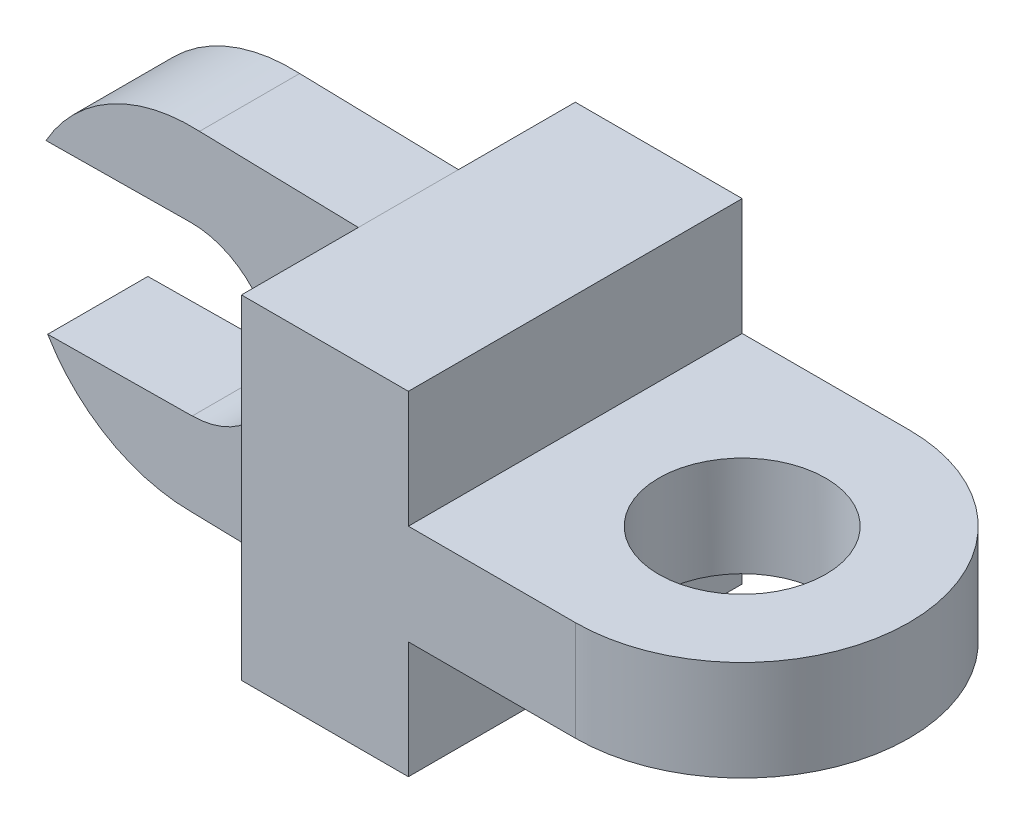
ISO-10303-21;
HEADER;
FILE_DESCRIPTION(('STEP AP214'),'2;1');
FILE_NAME('part.step','',(''),(''),'','','');
FILE_SCHEMA(('AUTOMOTIVE_DESIGN { 1 0 10303 214 1 1 1 1 }'));
ENDSEC;
DATA;
#1=APPLICATION_CONTEXT('core data for automotive mechanical design processes');
#2=APPLICATION_PROTOCOL_DEFINITION('international standard','automotive_design',2000,#1);
#3=PRODUCT_CONTEXT('',#1,'mechanical');
#4=PRODUCT('Part','Part','',(#3));
#5=PRODUCT_RELATED_PRODUCT_CATEGORY('part','',(#4));
#6=PRODUCT_DEFINITION_FORMATION('','',#4);
#7=PRODUCT_DEFINITION_CONTEXT('part definition',#1,'design');
#8=PRODUCT_DEFINITION('design','',#6,#7);
#9=PRODUCT_DEFINITION_SHAPE('','',#8);
#10=(LENGTH_UNIT() NAMED_UNIT(*) SI_UNIT(.MILLI.,.METRE.));
#11=(NAMED_UNIT(*) PLANE_ANGLE_UNIT() SI_UNIT($,.RADIAN.));
#12=(NAMED_UNIT(*) SI_UNIT($,.STERADIAN.) SOLID_ANGLE_UNIT());
#13=UNCERTAINTY_MEASURE_WITH_UNIT(LENGTH_MEASURE(1.E-05),#10,'distance_accuracy_value','');
#14=(GEOMETRIC_REPRESENTATION_CONTEXT(3) GLOBAL_UNCERTAINTY_ASSIGNED_CONTEXT((#13)) GLOBAL_UNIT_ASSIGNED_CONTEXT((#10,
#11,#12)) REPRESENTATION_CONTEXT('',''));
#15=CARTESIAN_POINT('',(0.,0.,0.));
#16=DIRECTION('',(0.,0.,1.));
#17=DIRECTION('',(1.,0.,0.));
#18=AXIS2_PLACEMENT_3D('',#15,#16,#17);
#19=CARTESIAN_POINT('',(-100.,51.2184310821307,15.));
#20=DIRECTION('',(0.,0.,-1.));
#21=DIRECTION('',(-1.,0.,0.));
#22=AXIS2_PLACEMENT_3D('',#19,#20,#21);
#23=CYLINDRICAL_SURFACE('',#22,50.);
#24=CARTESIAN_POINT('',(-100.,51.2184310821307,-15.));
#25=DIRECTION('',(0.,0.,1.));
#26=DIRECTION('',(1.,0.,0.));
#27=AXIS2_PLACEMENT_3D('',#24,#25,#26);
#28=CIRCLE('',#27,50.);
#29=CARTESIAN_POINT('',(-97.5645840581075,101.1590833525,-15.));
#30=VERTEX_POINT('',#29);
#31=CARTESIAN_POINT('',(-143.554760872011,75.7741392857638,-15.));
#32=VERTEX_POINT('',#31);
#33=EDGE_CURVE('E190',#30,#32,#28,.T.);
#34=ORIENTED_EDGE('',*,*,#33,.T.);
#35=DIRECTION('',(0.,0.,-1.));
#36=VECTOR('',#35,1.);
#37=CARTESIAN_POINT('',(-143.554760872011,75.7741392857638,15.));
#38=LINE('',#37,#36);
#39=CARTESIAN_POINT('',(-143.554760872011,75.7741392857638,15.));
#40=VERTEX_POINT('',#39);
#41=EDGE_CURVE('E170',#32,#40,#38,.F.);
#42=ORIENTED_EDGE('',*,*,#41,.T.);
#43=CARTESIAN_POINT('',(-100.,51.2184310821307,15.));
#44=DIRECTION('',(0.,0.,1.));
#45=DIRECTION('',(1.,0.,0.));
#46=AXIS2_PLACEMENT_3D('',#43,#44,#45);
#47=CIRCLE('',#46,50.);
#48=CARTESIAN_POINT('',(-97.5645840581075,101.1590833525,15.));
#49=VERTEX_POINT('',#48);
#50=EDGE_CURVE('E182',#49,#40,#47,.T.);
#51=ORIENTED_EDGE('',*,*,#50,.F.);
#52=DIRECTION('',(0.,0.,-1.));
#53=VECTOR('',#52,1.);
#54=CARTESIAN_POINT('',(-97.5645840581075,101.1590833525,15.));
#55=LINE('',#54,#53);
#56=EDGE_CURVE('E199',#49,#30,#55,.T.);
#57=ORIENTED_EDGE('',*,*,#56,.T.);
#58=EDGE_LOOP('',(#34,#42,#51,#57));
#59=FACE_BOUND('',#58,.T.);
#60=ADVANCED_FACE('F32',(#59),#23,.T.);
#61=CARTESIAN_POINT('',(-50.,100.,-50.));
#62=DIRECTION('',(1.,0.,0.));
#63=DIRECTION('',(0.,0.,-1.));
#64=AXIS2_PLACEMENT_3D('',#61,#62,#63);
#65=PLANE('',#64);
#66=DIRECTION('',(0.,1.,0.));
#67=VECTOR('',#66,1.);
#68=CARTESIAN_POINT('',(-50.,100.,15.));
#69=LINE('',#68,#67);
#70=CARTESIAN_POINT('',(-50.,0.,15.));
#71=VERTEX_POINT('',#70);
#72=CARTESIAN_POINT('',(-50.,100.,15.));
#73=VERTEX_POINT('',#72);
#74=EDGE_CURVE('E175',#71,#73,#69,.T.);
#75=ORIENTED_EDGE('',*,*,#74,.F.);
#76=DIRECTION('',(0.,0.,1.));
#77=VECTOR('',#76,1.);
#78=CARTESIAN_POINT('',(-50.,0.,-50.));
#79=LINE('',#78,#77);
#80=CARTESIAN_POINT('',(-50.,0.,50.));
#81=VERTEX_POINT('',#80);
#82=EDGE_CURVE('E261',#71,#81,#79,.T.);
#83=ORIENTED_EDGE('',*,*,#82,.T.);
#84=DIRECTION('',(0.,-1.,0.));
#85=VECTOR('',#84,1.);
#86=CARTESIAN_POINT('',(-50.,100.,50.));
#87=LINE('',#86,#85);
#88=CARTESIAN_POINT('',(-50.,100.,50.));
#89=VERTEX_POINT('',#88);
#90=EDGE_CURVE('E255',#89,#81,#87,.T.);
#91=ORIENTED_EDGE('',*,*,#90,.F.);
#92=DIRECTION('',(0.,0.,1.));
#93=VECTOR('',#92,1.);
#94=CARTESIAN_POINT('',(-50.,100.,-50.));
#95=LINE('',#94,#93);
#96=EDGE_CURVE('E251',#73,#89,#95,.T.);
#97=ORIENTED_EDGE('',*,*,#96,.F.);
#98=EDGE_LOOP('',(#75,#83,#91,#97));
#99=FACE_BOUND('',#98,.T.);
#100=ADVANCED_FACE('F327',(#99),#65,.F.);
#101=CARTESIAN_POINT('',(-50.,100.,50.));
#102=DIRECTION('',(0.,0.,-1.));
#103=DIRECTION('',(-1.,0.,0.));
#104=AXIS2_PLACEMENT_3D('',#101,#102,#103);
#105=PLANE('',#104);
#106=DIRECTION('',(0.,-1.,0.));
#107=VECTOR('',#106,1.);
#108=CARTESIAN_POINT('',(0.,35.,50.));
#109=LINE('',#108,#107);
#110=CARTESIAN_POINT('',(0.,35.,50.));
#111=VERTEX_POINT('',#110);
#112=CARTESIAN_POINT('',(0.,0.,50.));
#113=VERTEX_POINT('',#112);
#114=EDGE_CURVE('E210',#111,#113,#109,.T.);
#115=ORIENTED_EDGE('',*,*,#114,.F.);
#116=DIRECTION('',(-1.,0.,0.));
#117=VECTOR('',#116,1.);
#118=CARTESIAN_POINT('',(0.,35.,50.));
#119=LINE('',#118,#117);
#120=CARTESIAN_POINT('',(50.,35.,50.));
#121=VERTEX_POINT('',#120);
#122=EDGE_CURVE('E205',#121,#111,#119,.T.);
#123=ORIENTED_EDGE('',*,*,#122,.F.);
#124=DIRECTION('',(0.,-1.,0.));
#125=VECTOR('',#124,1.);
#126=CARTESIAN_POINT('',(50.,100.,50.));
#127=LINE('',#126,#125);
#128=CARTESIAN_POINT('',(50.,65.,50.));
#129=VERTEX_POINT('',#128);
#130=EDGE_CURVE('E11',#129,#121,#127,.T.);
#131=ORIENTED_EDGE('',*,*,#130,.F.);
#132=DIRECTION('',(1.,0.,0.));
#133=VECTOR('',#132,1.);
#134=CARTESIAN_POINT('',(0.,65.,50.));
#135=LINE('',#134,#133);
#136=CARTESIAN_POINT('',(0.,65.,50.));
#137=VERTEX_POINT('',#136);
#138=EDGE_CURVE('E229',#137,#129,#135,.T.);
#139=ORIENTED_EDGE('',*,*,#138,.F.);
#140=DIRECTION('',(0.,-1.,0.));
#141=VECTOR('',#140,1.);
#142=CARTESIAN_POINT('',(0.,65.,50.));
#143=LINE('',#142,#141);
#144=CARTESIAN_POINT('',(0.,100.,50.));
#145=VERTEX_POINT('',#144);
#146=EDGE_CURVE('E224',#145,#137,#143,.T.);
#147=ORIENTED_EDGE('',*,*,#146,.F.);
#148=DIRECTION('',(1.,0.,0.));
#149=VECTOR('',#148,1.);
#150=CARTESIAN_POINT('',(-50.,100.,50.));
#151=LINE('',#150,#149);
#152=EDGE_CURVE('E244',#89,#145,#151,.T.);
#153=ORIENTED_EDGE('',*,*,#152,.F.);
#154=ORIENTED_EDGE('',*,*,#90,.T.);
#155=DIRECTION('',(1.,0.,0.));
#156=VECTOR('',#155,1.);
#157=CARTESIAN_POINT('',(-50.,0.,50.));
#158=LINE('',#157,#156);
#159=EDGE_CURVE('E243',#81,#113,#158,.T.);
#160=ORIENTED_EDGE('',*,*,#159,.T.);
#161=EDGE_LOOP('',(#115,#123,#131,#139,#147,#153,#154,#160));
#162=FACE_BOUND('',#161,.T.);
#163=ADVANCED_FACE('F34',(#162),#105,.F.);
#164=CARTESIAN_POINT('',(50.,100.,0.));
#165=DIRECTION('',(0.,-1.,0.));
#166=DIRECTION('',(0.,0.,-1.));
#167=AXIS2_PLACEMENT_3D('',#164,#165,#166);
#168=CYLINDRICAL_SURFACE('',#167,50.);
#169=ORIENTED_EDGE('',*,*,#130,.T.);
#170=CARTESIAN_POINT('',(50.,35.,0.));
#171=DIRECTION('',(0.,1.,0.));
#172=DIRECTION('',(0.,0.,1.));
#173=AXIS2_PLACEMENT_3D('',#170,#171,#172);
#174=CIRCLE('',#173,50.);
#175=CARTESIAN_POINT('',(50.,35.,-50.));
#176=VERTEX_POINT('',#175);
#177=EDGE_CURVE('E221',#121,#176,#174,.T.);
#178=ORIENTED_EDGE('',*,*,#177,.T.);
#179=DIRECTION('',(0.,-1.,0.));
#180=VECTOR('',#179,1.);
#181=CARTESIAN_POINT('',(50.,100.,-50.));
#182=LINE('',#181,#180);
#183=CARTESIAN_POINT('',(50.,65.,-50.));
#184=VERTEX_POINT('',#183);
#185=EDGE_CURVE('E41',#184,#176,#182,.T.);
#186=ORIENTED_EDGE('',*,*,#185,.F.);
#187=CARTESIAN_POINT('',(50.,65.,0.));
#188=DIRECTION('',(0.,-1.,0.));
#189=DIRECTION('',(0.,0.,-1.));
#190=AXIS2_PLACEMENT_3D('',#187,#188,#189);
#191=CIRCLE('',#190,50.);
#192=EDGE_CURVE('E240',#184,#129,#191,.T.);
#193=ORIENTED_EDGE('',*,*,#192,.T.);
#194=EDGE_LOOP('',(#169,#178,#186,#193));
#195=FACE_BOUND('',#194,.T.);
#196=ADVANCED_FACE('F299',(#195),#168,.T.);
#197=CARTESIAN_POINT('',(-50.,100.,-50.));
#198=DIRECTION('',(0.,0.,-1.));
#199=DIRECTION('',(-1.,0.,0.));
#200=AXIS2_PLACEMENT_3D('',#197,#198,#199);
#201=PLANE('',#200);
#202=DIRECTION('',(-1.,0.,0.));
#203=VECTOR('',#202,1.);
#204=CARTESIAN_POINT('',(0.,35.,-50.));
#205=LINE('',#204,#203);
#206=CARTESIAN_POINT('',(0.,35.,-50.));
#207=VERTEX_POINT('',#206);
#208=EDGE_CURVE('E206',#176,#207,#205,.T.);
#209=ORIENTED_EDGE('',*,*,#208,.T.);
#210=DIRECTION('',(0.,-1.,0.));
#211=VECTOR('',#210,1.);
#212=CARTESIAN_POINT('',(0.,35.,-50.));
#213=LINE('',#212,#211);
#214=CARTESIAN_POINT('',(0.,0.,-50.));
#215=VERTEX_POINT('',#214);
#216=EDGE_CURVE('E209',#207,#215,#213,.T.);
#217=ORIENTED_EDGE('',*,*,#216,.T.);
#218=DIRECTION('',(1.,0.,0.));
#219=VECTOR('',#218,1.);
#220=CARTESIAN_POINT('',(-50.,0.,-50.));
#221=LINE('',#220,#219);
#222=CARTESIAN_POINT('',(-50.,0.,-50.));
#223=VERTEX_POINT('',#222);
#224=EDGE_CURVE('E258',#223,#215,#221,.T.);
#225=ORIENTED_EDGE('',*,*,#224,.F.);
#226=DIRECTION('',(0.,-1.,0.));
#227=VECTOR('',#226,1.);
#228=CARTESIAN_POINT('',(-50.,100.,-50.));
#229=LINE('',#228,#227);
#230=CARTESIAN_POINT('',(-50.,100.,-50.));
#231=VERTEX_POINT('',#230);
#232=EDGE_CURVE('E266',#231,#223,#229,.T.);
#233=ORIENTED_EDGE('',*,*,#232,.F.);
#234=DIRECTION('',(1.,0.,0.));
#235=VECTOR('',#234,1.);
#236=CARTESIAN_POINT('',(-50.,100.,-50.));
#237=LINE('',#236,#235);
#238=CARTESIAN_POINT('',(0.,100.,-50.));
#239=VERTEX_POINT('',#238);
#240=EDGE_CURVE('E247',#231,#239,#237,.T.);
#241=ORIENTED_EDGE('',*,*,#240,.T.);
#242=DIRECTION('',(0.,-1.,0.));
#243=VECTOR('',#242,1.);
#244=CARTESIAN_POINT('',(0.,65.,-50.));
#245=LINE('',#244,#243);
#246=CARTESIAN_POINT('',(0.,65.,-50.));
#247=VERTEX_POINT('',#246);
#248=EDGE_CURVE('E225',#239,#247,#245,.T.);
#249=ORIENTED_EDGE('',*,*,#248,.T.);
#250=DIRECTION('',(1.,0.,0.));
#251=VECTOR('',#250,1.);
#252=CARTESIAN_POINT('',(0.,65.,-50.));
#253=LINE('',#252,#251);
#254=EDGE_CURVE('E228',#247,#184,#253,.T.);
#255=ORIENTED_EDGE('',*,*,#254,.T.);
#256=ORIENTED_EDGE('',*,*,#185,.T.);
#257=EDGE_LOOP('',(#209,#217,#225,#233,#241,#249,#255,#256));
#258=FACE_BOUND('',#257,.T.);
#259=ADVANCED_FACE('F282',(#258),#201,.T.);
#260=CARTESIAN_POINT('',(-50.,0.,-15.));
#261=VERTEX_POINT('',#260);
#262=EDGE_CURVE('E248',#223,#261,#79,.T.);
#263=ORIENTED_EDGE('',*,*,#262,.T.);
#264=DIRECTION('',(0.,1.,0.));
#265=VECTOR('',#264,1.);
#266=CARTESIAN_POINT('',(-50.,100.,-15.));
#267=LINE('',#266,#265);
#268=CARTESIAN_POINT('',(-50.,100.,-15.));
#269=VERTEX_POINT('',#268);
#270=EDGE_CURVE('E165',#261,#269,#267,.T.);
#271=ORIENTED_EDGE('',*,*,#270,.T.);
#272=EDGE_CURVE('E252',#231,#269,#95,.T.);
#273=ORIENTED_EDGE('',*,*,#272,.F.);
#274=ORIENTED_EDGE('',*,*,#232,.T.);
#275=EDGE_LOOP('',(#263,#271,#273,#274));
#276=FACE_BOUND('',#275,.T.);
#277=ADVANCED_FACE('F312',(#276),#65,.F.);
#278=CARTESIAN_POINT('',(50.,100.,0.));
#279=DIRECTION('',(0.,1.,0.));
#280=DIRECTION('',(0.,0.,1.));
#281=AXIS2_PLACEMENT_3D('',#278,#279,#280);
#282=PLANE('',#281);
#283=DIRECTION('',(0.,0.,1.));
#284=VECTOR('',#283,1.);
#285=CARTESIAN_POINT('',(0.,100.,-50.));
#286=LINE('',#285,#284);
#287=EDGE_CURVE('E232',#239,#145,#286,.T.);
#288=ORIENTED_EDGE('',*,*,#287,.F.);
#289=ORIENTED_EDGE('',*,*,#240,.F.);
#290=ORIENTED_EDGE('',*,*,#272,.T.);
#291=DIRECTION('',(0.,0.,-1.));
#292=VECTOR('',#291,1.);
#293=CARTESIAN_POINT('',(-50.,100.,15.));
#294=LINE('',#293,#292);
#295=EDGE_CURVE('E202',#73,#269,#294,.T.);
#296=ORIENTED_EDGE('',*,*,#295,.F.);
#297=ORIENTED_EDGE('',*,*,#96,.T.);
#298=ORIENTED_EDGE('',*,*,#152,.T.);
#299=EDGE_LOOP('',(#288,#289,#290,#296,#297,#298));
#300=FACE_BOUND('',#299,.T.);
#301=ADVANCED_FACE('F288',(#300),#282,.T.);
#302=CARTESIAN_POINT('',(50.,0.,0.));
#303=DIRECTION('',(0.,1.,0.));
#304=DIRECTION('',(0.,0.,1.));
#305=AXIS2_PLACEMENT_3D('',#302,#303,#304);
#306=PLANE('',#305);
#307=ORIENTED_EDGE('',*,*,#224,.T.);
#308=DIRECTION('',(0.,0.,1.));
#309=VECTOR('',#308,1.);
#310=CARTESIAN_POINT('',(0.,0.,-50.));
#311=LINE('',#310,#309);
#312=EDGE_CURVE('E216',#215,#113,#311,.T.);
#313=ORIENTED_EDGE('',*,*,#312,.T.);
#314=ORIENTED_EDGE('',*,*,#159,.F.);
#315=ORIENTED_EDGE('',*,*,#82,.F.);
#316=DIRECTION('',(0.,0.,-1.));
#317=VECTOR('',#316,1.);
#318=CARTESIAN_POINT('',(-50.,0.,15.));
#319=LINE('',#318,#317);
#320=EDGE_CURVE('E187',#71,#261,#319,.T.);
#321=ORIENTED_EDGE('',*,*,#320,.T.);
#322=ORIENTED_EDGE('',*,*,#262,.F.);
#323=EDGE_LOOP('',(#307,#313,#314,#315,#321,#322));
#324=FACE_BOUND('',#323,.T.);
#325=ADVANCED_FACE('F307',(#324),#306,.F.);
#326=CARTESIAN_POINT('',(50.,0.,0.));
#327=DIRECTION('',(0.,1.,0.));
#328=DIRECTION('',(0.,0.,1.));
#329=AXIS2_PLACEMENT_3D('',#326,#327,#328);
#330=CYLINDRICAL_SURFACE('',#329,25.);
#331=CARTESIAN_POINT('',(50.,35.,0.));
#332=DIRECTION('',(0.,1.,0.));
#333=DIRECTION('',(0.,0.,1.));
#334=AXIS2_PLACEMENT_3D('',#331,#332,#333);
#335=CIRCLE('',#334,25.);
#336=CARTESIAN_POINT('',(50.,35.,25.));
#337=VERTEX_POINT('',#336);
#338=EDGE_CURVE('E36',#337,#337,#335,.F.);
#339=ORIENTED_EDGE('',*,*,#338,.T.);
#340=EDGE_LOOP('',(#339));
#341=FACE_BOUND('',#340,.T.);
#342=CARTESIAN_POINT('',(50.,65.,0.));
#343=DIRECTION('',(0.,-1.,0.));
#344=DIRECTION('',(0.,0.,-1.));
#345=AXIS2_PLACEMENT_3D('',#342,#343,#344);
#346=CIRCLE('',#345,25.);
#347=CARTESIAN_POINT('',(50.,65.,-25.));
#348=VERTEX_POINT('',#347);
#349=EDGE_CURVE('E238',#348,#348,#346,.F.);
#350=ORIENTED_EDGE('',*,*,#349,.T.);
#351=EDGE_LOOP('',(#350));
#352=FACE_BOUND('',#351,.T.);
#353=ADVANCED_FACE('F272',(#341,#352),#330,.F.);
#354=CARTESIAN_POINT('',(0.,65.,-50.));
#355=DIRECTION('',(0.,-1.,0.));
#356=DIRECTION('',(0.,0.,-1.));
#357=AXIS2_PLACEMENT_3D('',#354,#355,#356);
#358=PLANE('',#357);
#359=ORIENTED_EDGE('',*,*,#349,.F.);
#360=EDGE_LOOP('',(#359));
#361=FACE_BOUND('',#360,.T.);
#362=ORIENTED_EDGE('',*,*,#254,.F.);
#363=DIRECTION('',(0.,0.,1.));
#364=VECTOR('',#363,1.);
#365=CARTESIAN_POINT('',(0.,65.,-50.));
#366=LINE('',#365,#364);
#367=EDGE_CURVE('E236',#247,#137,#366,.T.);
#368=ORIENTED_EDGE('',*,*,#367,.T.);
#369=ORIENTED_EDGE('',*,*,#138,.T.);
#370=ORIENTED_EDGE('',*,*,#192,.F.);
#371=EDGE_LOOP('',(#362,#368,#369,#370));
#372=FACE_BOUND('',#371,.T.);
#373=ADVANCED_FACE('F274',(#361,#372),#358,.F.);
#374=CARTESIAN_POINT('',(0.,65.,-50.));
#375=DIRECTION('',(-1.,0.,0.));
#376=DIRECTION('',(0.,-1.,0.));
#377=AXIS2_PLACEMENT_3D('',#374,#375,#376);
#378=PLANE('',#377);
#379=ORIENTED_EDGE('',*,*,#146,.T.);
#380=ORIENTED_EDGE('',*,*,#367,.F.);
#381=ORIENTED_EDGE('',*,*,#248,.F.);
#382=ORIENTED_EDGE('',*,*,#287,.T.);
#383=EDGE_LOOP('',(#379,#380,#381,#382));
#384=FACE_BOUND('',#383,.T.);
#385=ADVANCED_FACE('F277',(#384),#378,.F.);
#386=CARTESIAN_POINT('',(0.,35.,-50.));
#387=DIRECTION('',(0.,1.,0.));
#388=DIRECTION('',(0.,0.,1.));
#389=AXIS2_PLACEMENT_3D('',#386,#387,#388);
#390=PLANE('',#389);
#391=ORIENTED_EDGE('',*,*,#338,.F.);
#392=EDGE_LOOP('',(#391));
#393=FACE_BOUND('',#392,.T.);
#394=ORIENTED_EDGE('',*,*,#122,.T.);
#395=DIRECTION('',(0.,0.,1.));
#396=VECTOR('',#395,1.);
#397=CARTESIAN_POINT('',(0.,35.,-50.));
#398=LINE('',#397,#396);
#399=EDGE_CURVE('E213',#207,#111,#398,.T.);
#400=ORIENTED_EDGE('',*,*,#399,.F.);
#401=ORIENTED_EDGE('',*,*,#208,.F.);
#402=ORIENTED_EDGE('',*,*,#177,.F.);
#403=EDGE_LOOP('',(#394,#400,#401,#402));
#404=FACE_BOUND('',#403,.T.);
#405=ADVANCED_FACE('F303',(#393,#404),#390,.F.);
#406=CARTESIAN_POINT('',(0.,35.,-50.));
#407=DIRECTION('',(-1.,0.,0.));
#408=DIRECTION('',(0.,0.,1.));
#409=AXIS2_PLACEMENT_3D('',#406,#407,#408);
#410=PLANE('',#409);
#411=ORIENTED_EDGE('',*,*,#114,.T.);
#412=ORIENTED_EDGE('',*,*,#312,.F.);
#413=ORIENTED_EDGE('',*,*,#216,.F.);
#414=ORIENTED_EDGE('',*,*,#399,.T.);
#415=EDGE_LOOP('',(#411,#412,#413,#414));
#416=FACE_BOUND('',#415,.T.);
#417=ADVANCED_FACE('F305',(#416),#410,.F.);
#418=CARTESIAN_POINT('',(-97.5645840581075,101.1590833525,15.));
#419=DIRECTION('',(-0.0243613894575761,-0.999703217311866,0.));
#420=DIRECTION('',(0.999703217311866,-0.0243613894575761,0.));
#421=AXIS2_PLACEMENT_3D('',#418,#419,#420);
#422=PLANE('',#421);
#423=DIRECTION('',(-0.999703217311866,0.0243613894575761,0.));
#424=VECTOR('',#423,1.);
#425=CARTESIAN_POINT('',(-97.5645840581075,101.1590833525,-15.));
#426=LINE('',#425,#424);
#427=EDGE_CURVE('E168',#269,#30,#426,.T.);
#428=ORIENTED_EDGE('',*,*,#427,.T.);
#429=ORIENTED_EDGE('',*,*,#56,.F.);
#430=DIRECTION('',(-0.999703217311866,0.0243613894575761,0.));
#431=VECTOR('',#430,1.);
#432=CARTESIAN_POINT('',(-97.5645840581075,101.1590833525,15.));
#433=LINE('',#432,#431);
#434=EDGE_CURVE('E178',#73,#49,#433,.T.);
#435=ORIENTED_EDGE('',*,*,#434,.F.);
#436=ORIENTED_EDGE('',*,*,#295,.T.);
#437=EDGE_LOOP('',(#428,#429,#435,#436));
#438=FACE_BOUND('',#437,.T.);
#439=ADVANCED_FACE('F319',(#438),#422,.F.);
#440=CARTESIAN_POINT('',(-143.04324754827,25.7767558130296,15.));
#441=VERTEX_POINT('',#440);
#442=CARTESIAN_POINT('',(-100.,1.21843108213065,15.));
#443=VERTEX_POINT('',#442);
#444=EDGE_CURVE('E181',#441,#443,#47,.T.);
#445=ORIENTED_EDGE('',*,*,#444,.F.);
#446=DIRECTION('',(0.,0.,-1.));
#447=VECTOR('',#446,1.);
#448=CARTESIAN_POINT('',(-143.04324754827,25.7767558130296,15.));
#449=LINE('',#448,#447);
#450=CARTESIAN_POINT('',(-143.04324754827,25.7767558130296,-15.));
#451=VERTEX_POINT('',#450);
#452=EDGE_CURVE('E334',#441,#451,#449,.T.);
#453=ORIENTED_EDGE('',*,*,#452,.T.);
#454=CARTESIAN_POINT('',(-100.,1.21843108213065,-15.));
#455=VERTEX_POINT('',#454);
#456=EDGE_CURVE('E161',#451,#455,#28,.T.);
#457=ORIENTED_EDGE('',*,*,#456,.T.);
#458=DIRECTION('',(0.,0.,-1.));
#459=VECTOR('',#458,1.);
#460=CARTESIAN_POINT('',(-100.,1.21843108213065,15.));
#461=LINE('',#460,#459);
#462=EDGE_CURVE('E196',#443,#455,#461,.T.);
#463=ORIENTED_EDGE('',*,*,#462,.F.);
#464=EDGE_LOOP('',(#445,#453,#457,#463));
#465=FACE_BOUND('',#464,.T.);
#466=ADVANCED_FACE('F333',(#465),#23,.T.);
#467=CARTESIAN_POINT('',(-50.,0.,15.));
#468=DIRECTION('',(0.0243613894575759,0.999703217311866,0.));
#469=DIRECTION('',(-0.999703217311866,0.0243613894575759,0.));
#470=AXIS2_PLACEMENT_3D('',#467,#468,#469);
#471=PLANE('',#470);
#472=DIRECTION('',(0.999703217311866,-0.0243613894575759,0.));
#473=VECTOR('',#472,1.);
#474=CARTESIAN_POINT('',(-50.,0.,-15.));
#475=LINE('',#474,#473);
#476=EDGE_CURVE('E179',#455,#261,#475,.T.);
#477=ORIENTED_EDGE('',*,*,#476,.T.);
#478=ORIENTED_EDGE('',*,*,#320,.F.);
#479=DIRECTION('',(0.999703217311866,-0.0243613894575759,0.));
#480=VECTOR('',#479,1.);
#481=CARTESIAN_POINT('',(-50.,0.,15.));
#482=LINE('',#481,#480);
#483=EDGE_CURVE('E185',#443,#71,#482,.T.);
#484=ORIENTED_EDGE('',*,*,#483,.F.);
#485=ORIENTED_EDGE('',*,*,#462,.T.);
#486=EDGE_LOOP('',(#477,#478,#484,#485));
#487=FACE_BOUND('',#486,.T.);
#488=ADVANCED_FACE('F329',(#487),#471,.F.);
#489=CARTESIAN_POINT('',(-100.,51.2184310821307,15.));
#490=DIRECTION('',(0.,0.,1.));
#491=DIRECTION('',(1.,0.,0.));
#492=AXIS2_PLACEMENT_3D('',#489,#490,#491);
#493=PLANE('',#492);
#494=DIRECTION('',(-0.999947669454684,-0.0102302664748204,0.));
#495=VECTOR('',#494,1.);
#496=CARTESIAN_POINT('',(-219.350144277916,74.9986917363671,15.));
#497=LINE('',#496,#495);
#498=CARTESIAN_POINT('',(-100.255756661871,76.2171228184978,15.));
#499=VERTEX_POINT('',#498);
#500=EDGE_CURVE('E162',#499,#40,#497,.T.);
#501=ORIENTED_EDGE('',*,*,#500,.F.);
#502=CARTESIAN_POINT('',(-100.,51.2184310821307,15.));
#503=DIRECTION('',(0.,0.,1.));
#504=DIRECTION('',(1.,0.,0.));
#505=AXIS2_PLACEMENT_3D('',#502,#503,#504);
#506=CIRCLE('',#505,25.);
#507=CARTESIAN_POINT('',(-99.7442433381295,26.2197393457636,15.));
#508=VERTEX_POINT('',#507);
#509=EDGE_CURVE('E166',#508,#499,#506,.T.);
#510=ORIENTED_EDGE('',*,*,#509,.F.);
#511=DIRECTION('',(0.999947669454684,0.0102302664748204,0.));
#512=VECTOR('',#511,1.);
#513=CARTESIAN_POINT('',(-218.838630954175,25.0013082636329,15.));
#514=LINE('',#513,#512);
#515=EDGE_CURVE('E49',#441,#508,#514,.T.);
#516=ORIENTED_EDGE('',*,*,#515,.F.);
#517=ORIENTED_EDGE('',*,*,#444,.T.);
#518=ORIENTED_EDGE('',*,*,#483,.T.);
#519=ORIENTED_EDGE('',*,*,#74,.T.);
#520=ORIENTED_EDGE('',*,*,#434,.T.);
#521=ORIENTED_EDGE('',*,*,#50,.T.);
#522=EDGE_LOOP('',(#501,#510,#516,#517,#518,#519,#520,#521));
#523=FACE_BOUND('',#522,.T.);
#524=ADVANCED_FACE('F323',(#523),#493,.T.);
#525=CARTESIAN_POINT('',(-100.,51.2184310821307,-15.));
#526=DIRECTION('',(0.,0.,1.));
#527=DIRECTION('',(1.,0.,0.));
#528=AXIS2_PLACEMENT_3D('',#525,#526,#527);
#529=PLANE('',#528);
#530=CARTESIAN_POINT('',(-100.,51.2184310821307,-15.));
#531=DIRECTION('',(0.,0.,1.));
#532=DIRECTION('',(1.,0.,0.));
#533=AXIS2_PLACEMENT_3D('',#530,#531,#532);
#534=CIRCLE('',#533,25.);
#535=CARTESIAN_POINT('',(-99.7442433381295,26.2197393457636,-15.));
#536=VERTEX_POINT('',#535);
#537=CARTESIAN_POINT('',(-100.255756661871,76.2171228184978,-15.));
#538=VERTEX_POINT('',#537);
#539=EDGE_CURVE('E159',#536,#538,#534,.T.);
#540=ORIENTED_EDGE('',*,*,#539,.T.);
#541=DIRECTION('',(-0.999947669454684,-0.0102302664748204,0.));
#542=VECTOR('',#541,1.);
#543=CARTESIAN_POINT('',(-219.350144277916,74.9986917363671,-15.));
#544=LINE('',#543,#542);
#545=EDGE_CURVE('E57',#538,#32,#544,.T.);
#546=ORIENTED_EDGE('',*,*,#545,.T.);
#547=ORIENTED_EDGE('',*,*,#33,.F.);
#548=ORIENTED_EDGE('',*,*,#427,.F.);
#549=ORIENTED_EDGE('',*,*,#270,.F.);
#550=ORIENTED_EDGE('',*,*,#476,.F.);
#551=ORIENTED_EDGE('',*,*,#456,.F.);
#552=DIRECTION('',(0.999947669454684,0.0102302664748204,0.));
#553=VECTOR('',#552,1.);
#554=CARTESIAN_POINT('',(-218.838630954175,25.0013082636329,-15.));
#555=LINE('',#554,#553);
#556=EDGE_CURVE('E147',#451,#536,#555,.T.);
#557=ORIENTED_EDGE('',*,*,#556,.T.);
#558=EDGE_LOOP('',(#540,#546,#547,#548,#549,#550,#551,#557));
#559=FACE_BOUND('',#558,.T.);
#560=ADVANCED_FACE('F158',(#559),#529,.F.);
#561=CARTESIAN_POINT('',(-100.,51.2184310821307,-15.));
#562=DIRECTION('',(0.,0.,1.));
#563=DIRECTION('',(1.,0.,0.));
#564=AXIS2_PLACEMENT_3D('',#561,#562,#563);
#565=CYLINDRICAL_SURFACE('',#564,25.);
#566=ORIENTED_EDGE('',*,*,#509,.T.);
#567=DIRECTION('',(0.,0.,1.));
#568=VECTOR('',#567,1.);
#569=CARTESIAN_POINT('',(-100.255756661871,76.2171228184978,-15.));
#570=LINE('',#569,#568);
#571=EDGE_CURVE('E153',#538,#499,#570,.T.);
#572=ORIENTED_EDGE('',*,*,#571,.F.);
#573=ORIENTED_EDGE('',*,*,#539,.F.);
#574=DIRECTION('',(0.,0.,1.));
#575=VECTOR('',#574,1.);
#576=CARTESIAN_POINT('',(-99.7442433381295,26.2197393457636,-15.));
#577=LINE('',#576,#575);
#578=EDGE_CURVE('E144',#536,#508,#577,.T.);
#579=ORIENTED_EDGE('',*,*,#578,.T.);
#580=EDGE_LOOP('',(#566,#572,#573,#579));
#581=FACE_BOUND('',#580,.T.);
#582=ADVANCED_FACE('F164',(#581),#565,.F.);
#583=CARTESIAN_POINT('',(-218.838630954175,25.0013082636329,-15.));
#584=DIRECTION('',(0.0102302664748204,-0.999947669454684,0.));
#585=DIRECTION('',(0.999947669454684,0.0102302664748204,0.));
#586=AXIS2_PLACEMENT_3D('',#583,#584,#585);
#587=PLANE('',#586);
#588=ORIENTED_EDGE('',*,*,#515,.T.);
#589=ORIENTED_EDGE('',*,*,#578,.F.);
#590=ORIENTED_EDGE('',*,*,#556,.F.);
#591=ORIENTED_EDGE('',*,*,#452,.F.);
#592=EDGE_LOOP('',(#588,#589,#590,#591));
#593=FACE_BOUND('',#592,.T.);
#594=ADVANCED_FACE('F146',(#593),#587,.F.);
#595=CARTESIAN_POINT('',(-219.350144277916,74.9986917363671,-15.));
#596=DIRECTION('',(-0.0102302664748204,0.999947669454684,0.));
#597=DIRECTION('',(-0.999947669454684,-0.0102302664748204,0.));
#598=AXIS2_PLACEMENT_3D('',#595,#596,#597);
#599=PLANE('',#598);
#600=ORIENTED_EDGE('',*,*,#545,.F.);
#601=ORIENTED_EDGE('',*,*,#571,.T.);
#602=ORIENTED_EDGE('',*,*,#500,.T.);
#603=ORIENTED_EDGE('',*,*,#41,.F.);
#604=EDGE_LOOP('',(#600,#601,#602,#603));
#605=FACE_BOUND('',#604,.T.);
#606=ADVANCED_FACE('F341',(#605),#599,.F.);
#607=CLOSED_SHELL('',(#60,#100,#163,#196,#259,#277,#301,#325,#353,#373,#385,#405,#417,#439,#466,
#488,#524,#560,#582,#594,#606));
#608=MANIFOLD_SOLID_BREP('B2',#607);
#609=ADVANCED_BREP_SHAPE_REPRESENTATION('',(#18,#608),#14);
#610=SHAPE_DEFINITION_REPRESENTATION(#9,#609);
ENDSEC;
END-ISO-10303-21;
